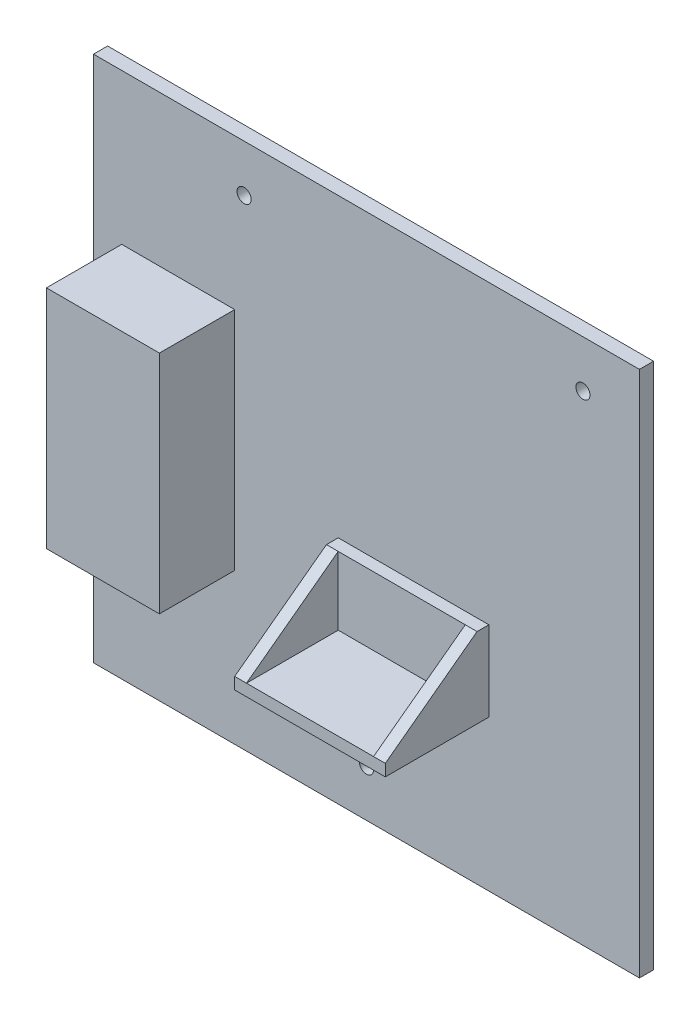
ISO-10303-21;
HEADER;
FILE_DESCRIPTION(('STEP AP214'),'2;1');
FILE_NAME('part.step','',(''),(''),'','','');
FILE_SCHEMA(('AUTOMOTIVE_DESIGN { 1 0 10303 214 1 1 1 1 }'));
ENDSEC;
DATA;
#1=APPLICATION_CONTEXT('core data for automotive mechanical design processes');
#2=APPLICATION_PROTOCOL_DEFINITION('international standard','automotive_design',2000,#1);
#3=PRODUCT_CONTEXT('',#1,'mechanical');
#4=PRODUCT('Part','Part','',(#3));
#5=PRODUCT_RELATED_PRODUCT_CATEGORY('part','',(#4));
#6=PRODUCT_DEFINITION_FORMATION('','',#4);
#7=PRODUCT_DEFINITION_CONTEXT('part definition',#1,'design');
#8=PRODUCT_DEFINITION('design','',#6,#7);
#9=PRODUCT_DEFINITION_SHAPE('','',#8);
#10=(LENGTH_UNIT() NAMED_UNIT(*) SI_UNIT(.MILLI.,.METRE.));
#11=(NAMED_UNIT(*) PLANE_ANGLE_UNIT() SI_UNIT($,.RADIAN.));
#12=(NAMED_UNIT(*) SI_UNIT($,.STERADIAN.) SOLID_ANGLE_UNIT());
#13=UNCERTAINTY_MEASURE_WITH_UNIT(LENGTH_MEASURE(1.E-05),#10,'distance_accuracy_value','');
#14=(GEOMETRIC_REPRESENTATION_CONTEXT(3) GLOBAL_UNCERTAINTY_ASSIGNED_CONTEXT((#13)) GLOBAL_UNIT_ASSIGNED_CONTEXT((#10,
#11,#12)) REPRESENTATION_CONTEXT('',''));
#15=CARTESIAN_POINT('',(0.,0.,0.));
#16=DIRECTION('',(0.,0.,1.));
#17=DIRECTION('',(1.,0.,0.));
#18=AXIS2_PLACEMENT_3D('',#15,#16,#17);
#19=CARTESIAN_POINT('',(-58.001,-21.5,25.));
#20=DIRECTION('',(0.,-0.802462340946133,-0.596702766344561));
#21=DIRECTION('',(0.,0.596702766344561,-0.802462340946133));
#22=AXIS2_PLACEMENT_3D('',#19,#20,#21);
#23=PLANE('',#22);
#24=DIRECTION('',(1.,0.,0.));
#25=VECTOR('',#24,1.);
#26=CARTESIAN_POINT('',(-58.001,-21.5,25.));
#27=LINE('',#26,#25);
#28=CARTESIAN_POINT('',(-6.00000000000001,-21.5,25.));
#29=VERTEX_POINT('',#28);
#30=CARTESIAN_POINT('',(-3.5,-21.5,25.));
#31=VERTEX_POINT('',#30);
#32=EDGE_CURVE('E183',#29,#31,#27,.T.);
#33=ORIENTED_EDGE('',*,*,#32,.T.);
#34=DIRECTION('',(0.,0.596702766344561,-0.802462340946133));
#35=VECTOR('',#34,1.);
#36=CARTESIAN_POINT('',(-3.5,-21.5,25.));
#37=LINE('',#36,#35);
#38=CARTESIAN_POINT('',(-3.50000000000001,-7.,5.5));
#39=VERTEX_POINT('',#38);
#40=EDGE_CURVE('E11',#31,#39,#37,.T.);
#41=ORIENTED_EDGE('',*,*,#40,.T.);
#42=DIRECTION('',(1.,0.,0.));
#43=VECTOR('',#42,1.);
#44=CARTESIAN_POINT('',(-58.001,-7.,5.5));
#45=LINE('',#44,#43);
#46=CARTESIAN_POINT('',(-6.00000000000001,-7.,5.5));
#47=VERTEX_POINT('',#46);
#48=EDGE_CURVE('E179',#47,#39,#45,.T.);
#49=ORIENTED_EDGE('',*,*,#48,.F.);
#50=DIRECTION('',(0.,-0.596702766344561,0.802462340946133));
#51=VECTOR('',#50,1.);
#52=CARTESIAN_POINT('',(-6.00000000000001,-21.5,25.));
#53=LINE('',#52,#51);
#54=EDGE_CURVE('E55',#47,#29,#53,.T.);
#55=ORIENTED_EDGE('',*,*,#54,.T.);
#56=EDGE_LOOP('',(#33,#41,#49,#55));
#57=FACE_BOUND('',#56,.T.);
#58=ADVANCED_FACE('F32',(#57),#23,.F.);
#59=CARTESIAN_POINT('',(0.,0.,3.));
#60=DIRECTION('',(0.,0.,-1.));
#61=DIRECTION('',(-1.,0.,0.));
#62=AXIS2_PLACEMENT_3D('',#59,#60,#61);
#63=PLANE('',#62);
#64=CARTESIAN_POINT('',(-26.,46.,3.));
#65=DIRECTION('',(0.,0.,1.));
#66=DIRECTION('',(1.,0.,0.));
#67=AXIS2_PLACEMENT_3D('',#64,#65,#66);
#68=CIRCLE('',#67,1.5);
#69=CARTESIAN_POINT('',(-24.5,46.,3.));
#70=VERTEX_POINT('',#69);
#71=EDGE_CURVE('E166',#70,#70,#68,.T.);
#72=ORIENTED_EDGE('',*,*,#71,.F.);
#73=EDGE_LOOP('',(#72));
#74=FACE_BOUND('',#73,.T.);
#75=CARTESIAN_POINT('',(46.,46.,3.));
#76=DIRECTION('',(0.,0.,1.));
#77=DIRECTION('',(1.,0.,0.));
#78=AXIS2_PLACEMENT_3D('',#75,#76,#77);
#79=CIRCLE('',#78,1.5);
#80=CARTESIAN_POINT('',(47.5,46.,3.));
#81=VERTEX_POINT('',#80);
#82=EDGE_CURVE('E362',#81,#81,#79,.T.);
#83=ORIENTED_EDGE('',*,*,#82,.F.);
#84=EDGE_LOOP('',(#83));
#85=FACE_BOUND('',#84,.T.);
#86=CARTESIAN_POINT('',(0.,-46.,3.));
#87=DIRECTION('',(0.,0.,1.));
#88=DIRECTION('',(1.,0.,0.));
#89=AXIS2_PLACEMENT_3D('',#86,#87,#88);
#90=CIRCLE('',#89,1.5);
#91=CARTESIAN_POINT('',(1.5,-46.,3.));
#92=VERTEX_POINT('',#91);
#93=EDGE_CURVE('E369',#92,#92,#90,.T.);
#94=ORIENTED_EDGE('',*,*,#93,.F.);
#95=EDGE_LOOP('',(#94));
#96=FACE_BOUND('',#95,.T.);
#97=DIRECTION('',(0.,1.,0.));
#98=VECTOR('',#97,1.);
#99=CARTESIAN_POINT('',(-28.,-24.,3.));
#100=LINE('',#99,#98);
#101=CARTESIAN_POINT('',(-28.,-24.,3.));
#102=VERTEX_POINT('',#101);
#103=CARTESIAN_POINT('',(-28.,24.,3.));
#104=VERTEX_POINT('',#103);
#105=EDGE_CURVE('E215',#102,#104,#100,.T.);
#106=ORIENTED_EDGE('',*,*,#105,.F.);
#107=DIRECTION('',(1.,0.,0.));
#108=VECTOR('',#107,1.);
#109=CARTESIAN_POINT('',(-52.,-24.,3.));
#110=LINE('',#109,#108);
#111=CARTESIAN_POINT('',(-52.,-24.,3.));
#112=VERTEX_POINT('',#111);
#113=EDGE_CURVE('E220',#112,#102,#110,.T.);
#114=ORIENTED_EDGE('',*,*,#113,.F.);
#115=DIRECTION('',(0.,-1.,0.));
#116=VECTOR('',#115,1.);
#117=CARTESIAN_POINT('',(-52.,-24.,3.));
#118=LINE('',#117,#116);
#119=CARTESIAN_POINT('',(-52.,24.,3.));
#120=VERTEX_POINT('',#119);
#121=EDGE_CURVE('E232',#120,#112,#118,.T.);
#122=ORIENTED_EDGE('',*,*,#121,.F.);
#123=DIRECTION('',(-1.,0.,0.));
#124=VECTOR('',#123,1.);
#125=CARTESIAN_POINT('',(-52.,24.,3.));
#126=LINE('',#125,#124);
#127=EDGE_CURVE('E229',#104,#120,#126,.T.);
#128=ORIENTED_EDGE('',*,*,#127,.F.);
#129=EDGE_LOOP('',(#106,#114,#122,#128));
#130=FACE_BOUND('',#129,.T.);
#131=DIRECTION('',(0.,1.,0.));
#132=VECTOR('',#131,1.);
#133=CARTESIAN_POINT('',(58.,-56.,3.));
#134=LINE('',#133,#132);
#135=CARTESIAN_POINT('',(58.,-56.,3.));
#136=VERTEX_POINT('',#135);
#137=CARTESIAN_POINT('',(58.,56.,3.));
#138=VERTEX_POINT('',#137);
#139=EDGE_CURVE('E249',#136,#138,#134,.T.);
#140=ORIENTED_EDGE('',*,*,#139,.T.);
#141=DIRECTION('',(-1.,0.,0.));
#142=VECTOR('',#141,1.);
#143=CARTESIAN_POINT('',(-58.,56.,3.));
#144=LINE('',#143,#142);
#145=CARTESIAN_POINT('',(-58.,56.,3.));
#146=VERTEX_POINT('',#145);
#147=EDGE_CURVE('E252',#138,#146,#144,.T.);
#148=ORIENTED_EDGE('',*,*,#147,.T.);
#149=DIRECTION('',(0.,-1.,0.));
#150=VECTOR('',#149,1.);
#151=CARTESIAN_POINT('',(-58.,-56.,3.));
#152=LINE('',#151,#150);
#153=CARTESIAN_POINT('',(-58.,-56.,3.));
#154=VERTEX_POINT('',#153);
#155=EDGE_CURVE('E255',#146,#154,#152,.T.);
#156=ORIENTED_EDGE('',*,*,#155,.T.);
#157=DIRECTION('',(1.,0.,0.));
#158=VECTOR('',#157,1.);
#159=CARTESIAN_POINT('',(-58.,-56.,3.));
#160=LINE('',#159,#158);
#161=EDGE_CURVE('E257',#154,#136,#160,.T.);
#162=ORIENTED_EDGE('',*,*,#161,.T.);
#163=EDGE_LOOP('',(#140,#148,#156,#162));
#164=FACE_BOUND('',#163,.T.);
#165=DIRECTION('',(0.,1.,0.));
#166=VECTOR('',#165,1.);
#167=CARTESIAN_POINT('',(26.,-24.,3.));
#168=LINE('',#167,#166);
#169=CARTESIAN_POINT('',(26.,-24.,3.));
#170=VERTEX_POINT('',#169);
#171=CARTESIAN_POINT('',(26.,-7.,3.));
#172=VERTEX_POINT('',#171);
#173=EDGE_CURVE('E186',#170,#172,#168,.T.);
#174=ORIENTED_EDGE('',*,*,#173,.F.);
#175=DIRECTION('',(1.,0.,0.));
#176=VECTOR('',#175,1.);
#177=CARTESIAN_POINT('',(-6.00000000000001,-24.,3.));
#178=LINE('',#177,#176);
#179=CARTESIAN_POINT('',(-6.00000000000001,-24.,3.));
#180=VERTEX_POINT('',#179);
#181=EDGE_CURVE('E191',#180,#170,#178,.T.);
#182=ORIENTED_EDGE('',*,*,#181,.F.);
#183=DIRECTION('',(0.,-1.,0.));
#184=VECTOR('',#183,1.);
#185=CARTESIAN_POINT('',(-6.00000000000001,-24.,3.));
#186=LINE('',#185,#184);
#187=CARTESIAN_POINT('',(-6.00000000000001,-7.,3.));
#188=VERTEX_POINT('',#187);
#189=EDGE_CURVE('E201',#188,#180,#186,.T.);
#190=ORIENTED_EDGE('',*,*,#189,.F.);
#191=DIRECTION('',(-1.,0.,0.));
#192=VECTOR('',#191,1.);
#193=CARTESIAN_POINT('',(-6.00000000000001,-7.,3.));
#194=LINE('',#193,#192);
#195=EDGE_CURVE('E198',#172,#188,#194,.T.);
#196=ORIENTED_EDGE('',*,*,#195,.F.);
#197=EDGE_LOOP('',(#174,#182,#190,#196));
#198=FACE_BOUND('',#197,.T.);
#199=ADVANCED_FACE('F296',(#74,#85,#96,#130,#164,#198),#63,.F.);
#200=CARTESIAN_POINT('',(58.,-56.,3.));
#201=DIRECTION('',(-1.,0.,0.));
#202=DIRECTION('',(0.,0.,1.));
#203=AXIS2_PLACEMENT_3D('',#200,#201,#202);
#204=PLANE('',#203);
#205=DIRECTION('',(0.,1.,0.));
#206=VECTOR('',#205,1.);
#207=CARTESIAN_POINT('',(58.,-56.,0.));
#208=LINE('',#207,#206);
#209=CARTESIAN_POINT('',(58.,-56.,0.));
#210=VERTEX_POINT('',#209);
#211=CARTESIAN_POINT('',(58.,56.,0.));
#212=VERTEX_POINT('',#211);
#213=EDGE_CURVE('E248',#210,#212,#208,.T.);
#214=ORIENTED_EDGE('',*,*,#213,.T.);
#215=DIRECTION('',(0.,0.,-1.));
#216=VECTOR('',#215,1.);
#217=CARTESIAN_POINT('',(58.,56.,3.));
#218=LINE('',#217,#216);
#219=EDGE_CURVE('E275',#138,#212,#218,.T.);
#220=ORIENTED_EDGE('',*,*,#219,.F.);
#221=ORIENTED_EDGE('',*,*,#139,.F.);
#222=DIRECTION('',(0.,0.,-1.));
#223=VECTOR('',#222,1.);
#224=CARTESIAN_POINT('',(58.,-56.,3.));
#225=LINE('',#224,#223);
#226=EDGE_CURVE('E259',#136,#210,#225,.T.);
#227=ORIENTED_EDGE('',*,*,#226,.T.);
#228=EDGE_LOOP('',(#214,#220,#221,#227));
#229=FACE_BOUND('',#228,.T.);
#230=ADVANCED_FACE('F34',(#229),#204,.F.);
#231=CARTESIAN_POINT('',(-58.,56.,3.));
#232=DIRECTION('',(0.,-1.,0.));
#233=DIRECTION('',(1.,0.,0.));
#234=AXIS2_PLACEMENT_3D('',#231,#232,#233);
#235=PLANE('',#234);
#236=DIRECTION('',(-1.,0.,0.));
#237=VECTOR('',#236,1.);
#238=CARTESIAN_POINT('',(-58.,56.,0.));
#239=LINE('',#238,#237);
#240=CARTESIAN_POINT('',(-58.,56.,0.));
#241=VERTEX_POINT('',#240);
#242=EDGE_CURVE('E262',#212,#241,#239,.T.);
#243=ORIENTED_EDGE('',*,*,#242,.T.);
#244=DIRECTION('',(0.,0.,-1.));
#245=VECTOR('',#244,1.);
#246=CARTESIAN_POINT('',(-58.,56.,3.));
#247=LINE('',#246,#245);
#248=EDGE_CURVE('E272',#146,#241,#247,.T.);
#249=ORIENTED_EDGE('',*,*,#248,.F.);
#250=ORIENTED_EDGE('',*,*,#147,.F.);
#251=ORIENTED_EDGE('',*,*,#219,.T.);
#252=EDGE_LOOP('',(#243,#249,#250,#251));
#253=FACE_BOUND('',#252,.T.);
#254=ADVANCED_FACE('F396',(#253),#235,.F.);
#255=CARTESIAN_POINT('',(-58.,-56.,3.));
#256=DIRECTION('',(1.,0.,0.));
#257=DIRECTION('',(0.,0.,-1.));
#258=AXIS2_PLACEMENT_3D('',#255,#256,#257);
#259=PLANE('',#258);
#260=DIRECTION('',(0.,-1.,0.));
#261=VECTOR('',#260,1.);
#262=CARTESIAN_POINT('',(-58.,-56.,0.));
#263=LINE('',#262,#261);
#264=CARTESIAN_POINT('',(-58.,-56.,0.));
#265=VERTEX_POINT('',#264);
#266=EDGE_CURVE('E264',#241,#265,#263,.T.);
#267=ORIENTED_EDGE('',*,*,#266,.T.);
#268=DIRECTION('',(0.,0.,-1.));
#269=VECTOR('',#268,1.);
#270=CARTESIAN_POINT('',(-58.,-56.,3.));
#271=LINE('',#270,#269);
#272=EDGE_CURVE('E269',#154,#265,#271,.T.);
#273=ORIENTED_EDGE('',*,*,#272,.F.);
#274=ORIENTED_EDGE('',*,*,#155,.F.);
#275=ORIENTED_EDGE('',*,*,#248,.T.);
#276=EDGE_LOOP('',(#267,#273,#274,#275));
#277=FACE_BOUND('',#276,.T.);
#278=ADVANCED_FACE('F393',(#277),#259,.F.);
#279=CARTESIAN_POINT('',(-58.,-56.,3.));
#280=DIRECTION('',(0.,1.,0.));
#281=DIRECTION('',(-1.,0.,0.));
#282=AXIS2_PLACEMENT_3D('',#279,#280,#281);
#283=PLANE('',#282);
#284=DIRECTION('',(1.,0.,0.));
#285=VECTOR('',#284,1.);
#286=CARTESIAN_POINT('',(-58.,-56.,0.));
#287=LINE('',#286,#285);
#288=EDGE_CURVE('E253',#265,#210,#287,.T.);
#289=ORIENTED_EDGE('',*,*,#288,.T.);
#290=ORIENTED_EDGE('',*,*,#226,.F.);
#291=ORIENTED_EDGE('',*,*,#161,.F.);
#292=ORIENTED_EDGE('',*,*,#272,.T.);
#293=EDGE_LOOP('',(#289,#290,#291,#292));
#294=FACE_BOUND('',#293,.T.);
#295=ADVANCED_FACE('F378',(#294),#283,.F.);
#296=CARTESIAN_POINT('',(0.,0.,0.));
#297=DIRECTION('',(0.,0.,-1.));
#298=DIRECTION('',(-1.,0.,0.));
#299=AXIS2_PLACEMENT_3D('',#296,#297,#298);
#300=PLANE('',#299);
#301=CARTESIAN_POINT('',(-26.,46.,0.));
#302=DIRECTION('',(0.,0.,-1.));
#303=DIRECTION('',(-1.,0.,0.));
#304=AXIS2_PLACEMENT_3D('',#301,#302,#303);
#305=CIRCLE('',#304,1.5);
#306=CARTESIAN_POINT('',(-27.5,46.,0.));
#307=VERTEX_POINT('',#306);
#308=EDGE_CURVE('E358',#307,#307,#305,.F.);
#309=ORIENTED_EDGE('',*,*,#308,.T.);
#310=EDGE_LOOP('',(#309));
#311=FACE_BOUND('',#310,.T.);
#312=CARTESIAN_POINT('',(46.,46.,0.));
#313=DIRECTION('',(0.,0.,-1.));
#314=DIRECTION('',(-1.,0.,0.));
#315=AXIS2_PLACEMENT_3D('',#312,#313,#314);
#316=CIRCLE('',#315,1.5);
#317=CARTESIAN_POINT('',(44.5,46.,0.));
#318=VERTEX_POINT('',#317);
#319=EDGE_CURVE('E367',#318,#318,#316,.F.);
#320=ORIENTED_EDGE('',*,*,#319,.T.);
#321=EDGE_LOOP('',(#320));
#322=FACE_BOUND('',#321,.T.);
#323=CARTESIAN_POINT('',(0.,-46.,0.));
#324=DIRECTION('',(0.,0.,-1.));
#325=DIRECTION('',(-1.,0.,0.));
#326=AXIS2_PLACEMENT_3D('',#323,#324,#325);
#327=CIRCLE('',#326,1.5);
#328=CARTESIAN_POINT('',(-1.5,-46.,0.));
#329=VERTEX_POINT('',#328);
#330=EDGE_CURVE('E169',#329,#329,#327,.F.);
#331=ORIENTED_EDGE('',*,*,#330,.T.);
#332=EDGE_LOOP('',(#331));
#333=FACE_BOUND('',#332,.T.);
#334=ORIENTED_EDGE('',*,*,#213,.F.);
#335=ORIENTED_EDGE('',*,*,#288,.F.);
#336=ORIENTED_EDGE('',*,*,#266,.F.);
#337=ORIENTED_EDGE('',*,*,#242,.F.);
#338=EDGE_LOOP('',(#334,#335,#336,#337));
#339=FACE_BOUND('',#338,.T.);
#340=ADVANCED_FACE('F374',(#311,#322,#333,#339),#300,.T.);
#341=CARTESIAN_POINT('',(-28.,-24.,19.));
#342=DIRECTION('',(-1.,0.,0.));
#343=DIRECTION('',(0.,0.,1.));
#344=AXIS2_PLACEMENT_3D('',#341,#342,#343);
#345=PLANE('',#344);
#346=ORIENTED_EDGE('',*,*,#105,.T.);
#347=DIRECTION('',(0.,0.,-1.));
#348=VECTOR('',#347,1.);
#349=CARTESIAN_POINT('',(-28.,24.,19.));
#350=LINE('',#349,#348);
#351=CARTESIAN_POINT('',(-28.,24.,19.));
#352=VERTEX_POINT('',#351);
#353=EDGE_CURVE('E245',#352,#104,#350,.T.);
#354=ORIENTED_EDGE('',*,*,#353,.F.);
#355=DIRECTION('',(0.,1.,0.));
#356=VECTOR('',#355,1.);
#357=CARTESIAN_POINT('',(-28.,-24.,19.));
#358=LINE('',#357,#356);
#359=CARTESIAN_POINT('',(-28.,-24.,19.));
#360=VERTEX_POINT('',#359);
#361=EDGE_CURVE('E216',#360,#352,#358,.T.);
#362=ORIENTED_EDGE('',*,*,#361,.F.);
#363=DIRECTION('',(0.,0.,-1.));
#364=VECTOR('',#363,1.);
#365=CARTESIAN_POINT('',(-28.,-24.,19.));
#366=LINE('',#365,#364);
#367=EDGE_CURVE('E226',#360,#102,#366,.T.);
#368=ORIENTED_EDGE('',*,*,#367,.T.);
#369=EDGE_LOOP('',(#346,#354,#362,#368));
#370=FACE_BOUND('',#369,.T.);
#371=ADVANCED_FACE('F377',(#370),#345,.F.);
#372=CARTESIAN_POINT('',(-52.,24.,19.));
#373=DIRECTION('',(0.,-1.,0.));
#374=DIRECTION('',(1.,0.,0.));
#375=AXIS2_PLACEMENT_3D('',#372,#373,#374);
#376=PLANE('',#375);
#377=ORIENTED_EDGE('',*,*,#127,.T.);
#378=DIRECTION('',(0.,0.,-1.));
#379=VECTOR('',#378,1.);
#380=CARTESIAN_POINT('',(-52.,24.,19.));
#381=LINE('',#380,#379);
#382=CARTESIAN_POINT('',(-52.,24.,19.));
#383=VERTEX_POINT('',#382);
#384=EDGE_CURVE('E242',#383,#120,#381,.T.);
#385=ORIENTED_EDGE('',*,*,#384,.F.);
#386=DIRECTION('',(-1.,0.,0.));
#387=VECTOR('',#386,1.);
#388=CARTESIAN_POINT('',(-52.,24.,19.));
#389=LINE('',#388,#387);
#390=EDGE_CURVE('E219',#352,#383,#389,.T.);
#391=ORIENTED_EDGE('',*,*,#390,.F.);
#392=ORIENTED_EDGE('',*,*,#353,.T.);
#393=EDGE_LOOP('',(#377,#385,#391,#392));
#394=FACE_BOUND('',#393,.T.);
#395=ADVANCED_FACE('F409',(#394),#376,.F.);
#396=CARTESIAN_POINT('',(-52.,-24.,19.));
#397=DIRECTION('',(1.,0.,0.));
#398=DIRECTION('',(0.,0.,-1.));
#399=AXIS2_PLACEMENT_3D('',#396,#397,#398);
#400=PLANE('',#399);
#401=ORIENTED_EDGE('',*,*,#121,.T.);
#402=DIRECTION('',(0.,0.,-1.));
#403=VECTOR('',#402,1.);
#404=CARTESIAN_POINT('',(-52.,-24.,19.));
#405=LINE('',#404,#403);
#406=CARTESIAN_POINT('',(-52.,-24.,19.));
#407=VERTEX_POINT('',#406);
#408=EDGE_CURVE('E239',#407,#112,#405,.T.);
#409=ORIENTED_EDGE('',*,*,#408,.F.);
#410=DIRECTION('',(0.,-1.,0.));
#411=VECTOR('',#410,1.);
#412=CARTESIAN_POINT('',(-52.,-24.,19.));
#413=LINE('',#412,#411);
#414=EDGE_CURVE('E222',#383,#407,#413,.T.);
#415=ORIENTED_EDGE('',*,*,#414,.F.);
#416=ORIENTED_EDGE('',*,*,#384,.T.);
#417=EDGE_LOOP('',(#401,#409,#415,#416));
#418=FACE_BOUND('',#417,.T.);
#419=ADVANCED_FACE('F413',(#418),#400,.F.);
#420=CARTESIAN_POINT('',(-52.,-24.,19.));
#421=DIRECTION('',(0.,1.,0.));
#422=DIRECTION('',(-1.,0.,0.));
#423=AXIS2_PLACEMENT_3D('',#420,#421,#422);
#424=PLANE('',#423);
#425=ORIENTED_EDGE('',*,*,#113,.T.);
#426=ORIENTED_EDGE('',*,*,#367,.F.);
#427=DIRECTION('',(1.,0.,0.));
#428=VECTOR('',#427,1.);
#429=CARTESIAN_POINT('',(-52.,-24.,19.));
#430=LINE('',#429,#428);
#431=EDGE_CURVE('E224',#407,#360,#430,.T.);
#432=ORIENTED_EDGE('',*,*,#431,.F.);
#433=ORIENTED_EDGE('',*,*,#408,.T.);
#434=EDGE_LOOP('',(#425,#426,#432,#433));
#435=FACE_BOUND('',#434,.T.);
#436=ADVANCED_FACE('F417',(#435),#424,.F.);
#437=CARTESIAN_POINT('',(0.,0.,19.));
#438=DIRECTION('',(0.,0.,-1.));
#439=DIRECTION('',(-1.,0.,0.));
#440=AXIS2_PLACEMENT_3D('',#437,#438,#439);
#441=PLANE('',#440);
#442=ORIENTED_EDGE('',*,*,#361,.T.);
#443=ORIENTED_EDGE('',*,*,#390,.T.);
#444=ORIENTED_EDGE('',*,*,#414,.T.);
#445=ORIENTED_EDGE('',*,*,#431,.T.);
#446=EDGE_LOOP('',(#442,#443,#444,#445));
#447=FACE_BOUND('',#446,.T.);
#448=ADVANCED_FACE('F421',(#447),#441,.F.);
#449=CARTESIAN_POINT('',(26.,-24.,25.));
#450=DIRECTION('',(-1.,0.,0.));
#451=DIRECTION('',(0.,0.,1.));
#452=AXIS2_PLACEMENT_3D('',#449,#450,#451);
#453=PLANE('',#452);
#454=DIRECTION('',(0.,0.,-1.));
#455=VECTOR('',#454,1.);
#456=CARTESIAN_POINT('',(26.,-7.,25.));
#457=LINE('',#456,#455);
#458=CARTESIAN_POINT('',(26.,-7.,5.5));
#459=VERTEX_POINT('',#458);
#460=EDGE_CURVE('E213',#459,#172,#457,.T.);
#461=ORIENTED_EDGE('',*,*,#460,.F.);
#462=DIRECTION('',(0.,0.596702766344561,-0.802462340946133));
#463=VECTOR('',#462,1.);
#464=CARTESIAN_POINT('',(26.,-21.5,25.));
#465=LINE('',#464,#463);
#466=CARTESIAN_POINT('',(26.,-21.5,25.));
#467=VERTEX_POINT('',#466);
#468=EDGE_CURVE('E174',#467,#459,#465,.T.);
#469=ORIENTED_EDGE('',*,*,#468,.F.);
#470=DIRECTION('',(0.,1.,0.));
#471=VECTOR('',#470,1.);
#472=CARTESIAN_POINT('',(26.,-24.,25.));
#473=LINE('',#472,#471);
#474=CARTESIAN_POINT('',(26.,-24.,25.));
#475=VERTEX_POINT('',#474);
#476=EDGE_CURVE('E187',#475,#467,#473,.T.);
#477=ORIENTED_EDGE('',*,*,#476,.F.);
#478=DIRECTION('',(0.,0.,-1.));
#479=VECTOR('',#478,1.);
#480=CARTESIAN_POINT('',(26.,-24.,25.));
#481=LINE('',#480,#479);
#482=EDGE_CURVE('E195',#475,#170,#481,.T.);
#483=ORIENTED_EDGE('',*,*,#482,.T.);
#484=ORIENTED_EDGE('',*,*,#173,.T.);
#485=EDGE_LOOP('',(#461,#469,#477,#483,#484));
#486=FACE_BOUND('',#485,.T.);
#487=ADVANCED_FACE('F289',(#486),#453,.F.);
#488=CARTESIAN_POINT('',(-6.00000000000001,-7.,25.));
#489=DIRECTION('',(0.,-1.,0.));
#490=DIRECTION('',(0.,0.,-1.));
#491=AXIS2_PLACEMENT_3D('',#488,#489,#490);
#492=PLANE('',#491);
#493=DIRECTION('',(0.,0.,-1.));
#494=VECTOR('',#493,1.);
#495=CARTESIAN_POINT('',(-6.00000000000001,-7.,25.));
#496=LINE('',#495,#494);
#497=EDGE_CURVE('E211',#47,#188,#496,.T.);
#498=ORIENTED_EDGE('',*,*,#497,.F.);
#499=ORIENTED_EDGE('',*,*,#48,.T.);
#500=DIRECTION('',(-1.,0.,0.));
#501=VECTOR('',#500,1.);
#502=CARTESIAN_POINT('',(-3.50000000000001,-7.,5.5));
#503=LINE('',#502,#501);
#504=CARTESIAN_POINT('',(23.5,-7.,5.5));
#505=VERTEX_POINT('',#504);
#506=EDGE_CURVE('E161',#505,#39,#503,.T.);
#507=ORIENTED_EDGE('',*,*,#506,.F.);
#508=EDGE_CURVE('E182',#505,#459,#45,.T.);
#509=ORIENTED_EDGE('',*,*,#508,.T.);
#510=ORIENTED_EDGE('',*,*,#460,.T.);
#511=ORIENTED_EDGE('',*,*,#195,.T.);
#512=EDGE_LOOP('',(#498,#499,#507,#509,#510,#511));
#513=FACE_BOUND('',#512,.T.);
#514=ADVANCED_FACE('F293',(#513),#492,.F.);
#515=CARTESIAN_POINT('',(-6.00000000000001,-24.,25.));
#516=DIRECTION('',(1.,0.,0.));
#517=DIRECTION('',(0.,0.,-1.));
#518=AXIS2_PLACEMENT_3D('',#515,#516,#517);
#519=PLANE('',#518);
#520=DIRECTION('',(0.,-1.,0.));
#521=VECTOR('',#520,1.);
#522=CARTESIAN_POINT('',(-6.00000000000001,-24.,25.));
#523=LINE('',#522,#521);
#524=CARTESIAN_POINT('',(-6.00000000000001,-24.,25.));
#525=VERTEX_POINT('',#524);
#526=EDGE_CURVE('E190',#29,#525,#523,.T.);
#527=ORIENTED_EDGE('',*,*,#526,.F.);
#528=ORIENTED_EDGE('',*,*,#54,.F.);
#529=ORIENTED_EDGE('',*,*,#497,.T.);
#530=ORIENTED_EDGE('',*,*,#189,.T.);
#531=DIRECTION('',(0.,0.,-1.));
#532=VECTOR('',#531,1.);
#533=CARTESIAN_POINT('',(-6.00000000000001,-24.,25.));
#534=LINE('',#533,#532);
#535=EDGE_CURVE('E208',#525,#180,#534,.T.);
#536=ORIENTED_EDGE('',*,*,#535,.F.);
#537=EDGE_LOOP('',(#527,#528,#529,#530,#536));
#538=FACE_BOUND('',#537,.T.);
#539=ADVANCED_FACE('F300',(#538),#519,.F.);
#540=CARTESIAN_POINT('',(-6.00000000000001,-24.,25.));
#541=DIRECTION('',(0.,1.,0.));
#542=DIRECTION('',(0.,0.,1.));
#543=AXIS2_PLACEMENT_3D('',#540,#541,#542);
#544=PLANE('',#543);
#545=ORIENTED_EDGE('',*,*,#181,.T.);
#546=ORIENTED_EDGE('',*,*,#482,.F.);
#547=DIRECTION('',(1.,0.,0.));
#548=VECTOR('',#547,1.);
#549=CARTESIAN_POINT('',(-6.00000000000001,-24.,25.));
#550=LINE('',#549,#548);
#551=EDGE_CURVE('E193',#525,#475,#550,.T.);
#552=ORIENTED_EDGE('',*,*,#551,.F.);
#553=ORIENTED_EDGE('',*,*,#535,.T.);
#554=EDGE_LOOP('',(#545,#546,#552,#553));
#555=FACE_BOUND('',#554,.T.);
#556=ADVANCED_FACE('F302',(#555),#544,.F.);
#557=CARTESIAN_POINT('',(0.,0.,25.));
#558=DIRECTION('',(0.,0.,-1.));
#559=DIRECTION('',(-1.,0.,0.));
#560=AXIS2_PLACEMENT_3D('',#557,#558,#559);
#561=PLANE('',#560);
#562=ORIENTED_EDGE('',*,*,#476,.T.);
#563=CARTESIAN_POINT('',(23.5,-21.5,25.));
#564=VERTEX_POINT('',#563);
#565=EDGE_CURVE('E178',#564,#467,#27,.T.);
#566=ORIENTED_EDGE('',*,*,#565,.F.);
#567=DIRECTION('',(1.,0.,0.));
#568=VECTOR('',#567,1.);
#569=CARTESIAN_POINT('',(23.5,-21.5,25.));
#570=LINE('',#569,#568);
#571=EDGE_CURVE('E151',#31,#564,#570,.T.);
#572=ORIENTED_EDGE('',*,*,#571,.F.);
#573=ORIENTED_EDGE('',*,*,#32,.F.);
#574=ORIENTED_EDGE('',*,*,#526,.T.);
#575=ORIENTED_EDGE('',*,*,#551,.T.);
#576=EDGE_LOOP('',(#562,#566,#572,#573,#574,#575));
#577=FACE_BOUND('',#576,.T.);
#578=ADVANCED_FACE('F283',(#577),#561,.F.);
#579=ORIENTED_EDGE('',*,*,#508,.F.);
#580=DIRECTION('',(0.,-0.596702766344561,0.802462340946133));
#581=VECTOR('',#580,1.);
#582=CARTESIAN_POINT('',(23.5,-21.5,25.));
#583=LINE('',#582,#581);
#584=EDGE_CURVE('E40',#505,#564,#583,.T.);
#585=ORIENTED_EDGE('',*,*,#584,.T.);
#586=ORIENTED_EDGE('',*,*,#565,.T.);
#587=ORIENTED_EDGE('',*,*,#468,.T.);
#588=EDGE_LOOP('',(#579,#585,#586,#587));
#589=FACE_BOUND('',#588,.T.);
#590=ADVANCED_FACE('F279',(#589),#23,.F.);
#591=CARTESIAN_POINT('',(-3.50000000000001,-7.,5.5));
#592=DIRECTION('',(-1.,0.,0.));
#593=DIRECTION('',(0.,0.,1.));
#594=AXIS2_PLACEMENT_3D('',#591,#592,#593);
#595=PLANE('',#594);
#596=DIRECTION('',(0.,0.,1.));
#597=VECTOR('',#596,1.);
#598=CARTESIAN_POINT('',(-3.50000000000001,-21.5,5.5));
#599=LINE('',#598,#597);
#600=CARTESIAN_POINT('',(-3.50000000000001,-21.5,5.5));
#601=VERTEX_POINT('',#600);
#602=EDGE_CURVE('E47',#601,#31,#599,.T.);
#603=ORIENTED_EDGE('',*,*,#602,.F.);
#604=DIRECTION('',(0.,-1.,0.));
#605=VECTOR('',#604,1.);
#606=CARTESIAN_POINT('',(-3.50000000000001,-7.,5.5));
#607=LINE('',#606,#605);
#608=EDGE_CURVE('E154',#39,#601,#607,.T.);
#609=ORIENTED_EDGE('',*,*,#608,.F.);
#610=ORIENTED_EDGE('',*,*,#40,.F.);
#611=EDGE_LOOP('',(#603,#609,#610));
#612=FACE_BOUND('',#611,.T.);
#613=ADVANCED_FACE('F320',(#612),#595,.F.);
#614=CARTESIAN_POINT('',(23.5,-21.5,5.5));
#615=DIRECTION('',(1.,0.,0.));
#616=DIRECTION('',(0.,0.,-1.));
#617=AXIS2_PLACEMENT_3D('',#614,#615,#616);
#618=PLANE('',#617);
#619=DIRECTION('',(0.,1.,0.));
#620=VECTOR('',#619,1.);
#621=CARTESIAN_POINT('',(23.5,-21.5,5.5));
#622=LINE('',#621,#620);
#623=CARTESIAN_POINT('',(23.5,-21.5,5.5));
#624=VERTEX_POINT('',#623);
#625=EDGE_CURVE('E157',#624,#505,#622,.T.);
#626=ORIENTED_EDGE('',*,*,#625,.F.);
#627=DIRECTION('',(0.,0.,1.));
#628=VECTOR('',#627,1.);
#629=CARTESIAN_POINT('',(23.5,-21.5,5.5));
#630=LINE('',#629,#628);
#631=EDGE_CURVE('E144',#624,#564,#630,.T.);
#632=ORIENTED_EDGE('',*,*,#631,.T.);
#633=ORIENTED_EDGE('',*,*,#584,.F.);
#634=EDGE_LOOP('',(#626,#632,#633));
#635=FACE_BOUND('',#634,.T.);
#636=ADVANCED_FACE('F158',(#635),#618,.F.);
#637=CARTESIAN_POINT('',(23.5,-21.5,5.5));
#638=DIRECTION('',(0.,-1.,0.));
#639=DIRECTION('',(0.,0.,-1.));
#640=AXIS2_PLACEMENT_3D('',#637,#638,#639);
#641=PLANE('',#640);
#642=ORIENTED_EDGE('',*,*,#571,.T.);
#643=ORIENTED_EDGE('',*,*,#631,.F.);
#644=DIRECTION('',(1.,0.,0.));
#645=VECTOR('',#644,1.);
#646=CARTESIAN_POINT('',(23.5,-21.5,5.5));
#647=LINE('',#646,#645);
#648=EDGE_CURVE('E148',#601,#624,#647,.T.);
#649=ORIENTED_EDGE('',*,*,#648,.F.);
#650=ORIENTED_EDGE('',*,*,#602,.T.);
#651=EDGE_LOOP('',(#642,#643,#649,#650));
#652=FACE_BOUND('',#651,.T.);
#653=ADVANCED_FACE('F146',(#652),#641,.F.);
#654=CARTESIAN_POINT('',(0.,0.,5.5));
#655=DIRECTION('',(0.,0.,1.));
#656=DIRECTION('',(1.,0.,0.));
#657=AXIS2_PLACEMENT_3D('',#654,#655,#656);
#658=PLANE('',#657);
#659=ORIENTED_EDGE('',*,*,#648,.T.);
#660=ORIENTED_EDGE('',*,*,#625,.T.);
#661=ORIENTED_EDGE('',*,*,#506,.T.);
#662=ORIENTED_EDGE('',*,*,#608,.T.);
#663=EDGE_LOOP('',(#659,#660,#661,#662));
#664=FACE_BOUND('',#663,.T.);
#665=ADVANCED_FACE('F163',(#664),#658,.T.);
#666=CARTESIAN_POINT('',(0.,-46.,-0.00100000000000013));
#667=DIRECTION('',(0.,0.,1.));
#668=DIRECTION('',(1.,0.,0.));
#669=AXIS2_PLACEMENT_3D('',#666,#667,#668);
#670=CYLINDRICAL_SURFACE('',#669,1.5);
#671=ORIENTED_EDGE('',*,*,#330,.F.);
#672=EDGE_LOOP('',(#671));
#673=FACE_BOUND('',#672,.T.);
#674=ORIENTED_EDGE('',*,*,#93,.T.);
#675=EDGE_LOOP('',(#674));
#676=FACE_BOUND('',#675,.T.);
#677=ADVANCED_FACE('F336',(#673,#676),#670,.F.);
#678=CARTESIAN_POINT('',(46.,46.,-0.00100000000000013));
#679=DIRECTION('',(0.,0.,1.));
#680=DIRECTION('',(1.,0.,0.));
#681=AXIS2_PLACEMENT_3D('',#678,#679,#680);
#682=CYLINDRICAL_SURFACE('',#681,1.5);
#683=ORIENTED_EDGE('',*,*,#319,.F.);
#684=EDGE_LOOP('',(#683));
#685=FACE_BOUND('',#684,.T.);
#686=ORIENTED_EDGE('',*,*,#82,.T.);
#687=EDGE_LOOP('',(#686));
#688=FACE_BOUND('',#687,.T.);
#689=ADVANCED_FACE('F340',(#685,#688),#682,.F.);
#690=CARTESIAN_POINT('',(-26.,46.,-0.00100000000000013));
#691=DIRECTION('',(0.,0.,1.));
#692=DIRECTION('',(1.,0.,0.));
#693=AXIS2_PLACEMENT_3D('',#690,#691,#692);
#694=CYLINDRICAL_SURFACE('',#693,1.5);
#695=ORIENTED_EDGE('',*,*,#308,.F.);
#696=EDGE_LOOP('',(#695));
#697=FACE_BOUND('',#696,.T.);
#698=ORIENTED_EDGE('',*,*,#71,.T.);
#699=EDGE_LOOP('',(#698));
#700=FACE_BOUND('',#699,.T.);
#701=ADVANCED_FACE('F345',(#697,#700),#694,.F.);
#702=CLOSED_SHELL('',(#58,#199,#230,#254,#278,#295,#340,#371,#395,#419,#436,#448,#487,#514,#539,
#556,#578,#590,#613,#636,#653,#665,#677,#689,#701));
#703=MANIFOLD_SOLID_BREP('B2',#702);
#704=ADVANCED_BREP_SHAPE_REPRESENTATION('',(#18,#703),#14);
#705=SHAPE_DEFINITION_REPRESENTATION(#9,#704);
ENDSEC;
END-ISO-10303-21;
